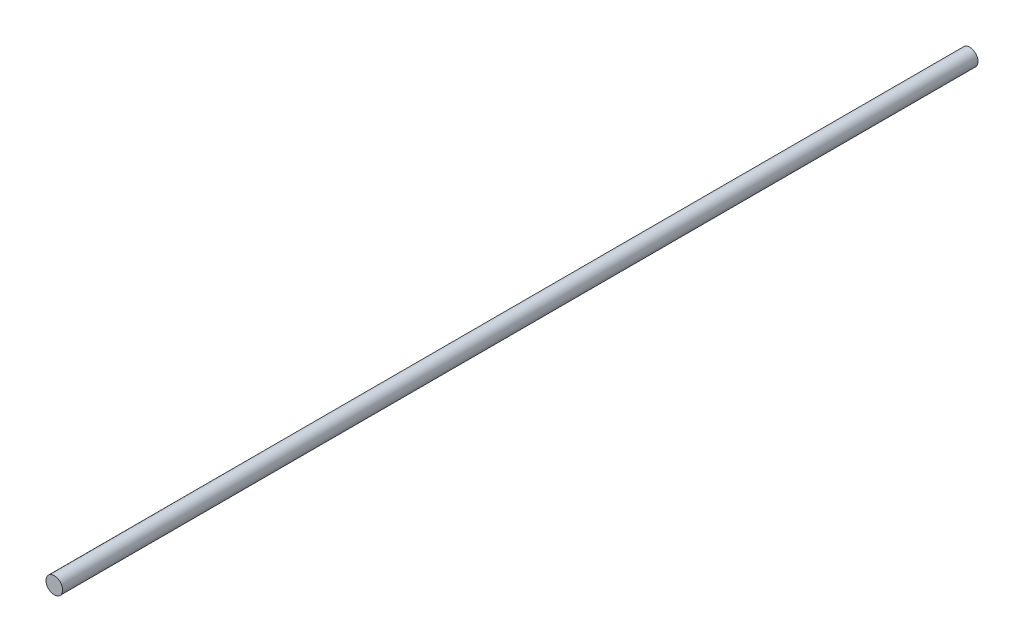
ISO-10303-21;
HEADER;
FILE_DESCRIPTION(('STEP AP214'),'2;1');
FILE_NAME('part.step','',(''),(''),'','','');
FILE_SCHEMA(('AUTOMOTIVE_DESIGN { 1 0 10303 214 1 1 1 1 }'));
ENDSEC;
DATA;
#1=APPLICATION_CONTEXT('core data for automotive mechanical design processes');
#2=APPLICATION_PROTOCOL_DEFINITION('international standard','automotive_design',2000,#1);
#3=PRODUCT_CONTEXT('',#1,'mechanical');
#4=PRODUCT('Part','Part','',(#3));
#5=PRODUCT_RELATED_PRODUCT_CATEGORY('part','',(#4));
#6=PRODUCT_DEFINITION_FORMATION('','',#4);
#7=PRODUCT_DEFINITION_CONTEXT('part definition',#1,'design');
#8=PRODUCT_DEFINITION('design','',#6,#7);
#9=PRODUCT_DEFINITION_SHAPE('','',#8);
#10=(LENGTH_UNIT() NAMED_UNIT(*) SI_UNIT(.MILLI.,.METRE.));
#11=(NAMED_UNIT(*) PLANE_ANGLE_UNIT() SI_UNIT($,.RADIAN.));
#12=(NAMED_UNIT(*) SI_UNIT($,.STERADIAN.) SOLID_ANGLE_UNIT());
#13=UNCERTAINTY_MEASURE_WITH_UNIT(LENGTH_MEASURE(1.E-05),#10,'distance_accuracy_value','');
#14=(GEOMETRIC_REPRESENTATION_CONTEXT(3) GLOBAL_UNCERTAINTY_ASSIGNED_CONTEXT((#13)) GLOBAL_UNIT_ASSIGNED_CONTEXT((#10,
#11,#12)) REPRESENTATION_CONTEXT('',''));
#15=CARTESIAN_POINT('',(0.,0.,0.));
#16=DIRECTION('',(0.,0.,1.));
#17=DIRECTION('',(1.,0.,0.));
#18=AXIS2_PLACEMENT_3D('',#15,#16,#17);
#19=CARTESIAN_POINT('',(0.,0.,662.));
#20=DIRECTION('',(0.,0.,-1.));
#21=DIRECTION('',(-1.,0.,0.));
#22=AXIS2_PLACEMENT_3D('',#19,#20,#21);
#23=CYLINDRICAL_SURFACE('',#22,6.);
#24=CARTESIAN_POINT('',(0.,0.,662.));
#25=DIRECTION('',(0.,0.,1.));
#26=DIRECTION('',(1.,0.,0.));
#27=AXIS2_PLACEMENT_3D('',#24,#25,#26);
#28=CIRCLE('',#27,6.);
#29=CARTESIAN_POINT('',(6.,0.,662.));
#30=VERTEX_POINT('',#29);
#31=EDGE_CURVE('E10',#30,#30,#28,.T.);
#32=ORIENTED_EDGE('',*,*,#31,.F.);
#33=EDGE_LOOP('',(#32));
#34=FACE_BOUND('',#33,.T.);
#35=CARTESIAN_POINT('',(0.,0.,0.));
#36=DIRECTION('',(0.,0.,1.));
#37=DIRECTION('',(1.,0.,0.));
#38=AXIS2_PLACEMENT_3D('',#35,#36,#37);
#39=CIRCLE('',#38,6.);
#40=CARTESIAN_POINT('',(6.,0.,0.));
#41=VERTEX_POINT('',#40);
#42=EDGE_CURVE('E34',#41,#41,#39,.T.);
#43=ORIENTED_EDGE('',*,*,#42,.T.);
#44=EDGE_LOOP('',(#43));
#45=FACE_BOUND('',#44,.T.);
#46=ADVANCED_FACE('F31',(#34,#45),#23,.T.);
#47=CARTESIAN_POINT('',(0.,0.,662.));
#48=DIRECTION('',(0.,0.,1.));
#49=DIRECTION('',(1.,0.,0.));
#50=AXIS2_PLACEMENT_3D('',#47,#48,#49);
#51=PLANE('',#50);
#52=ORIENTED_EDGE('',*,*,#31,.T.);
#53=EDGE_LOOP('',(#52));
#54=FACE_BOUND('',#53,.T.);
#55=ADVANCED_FACE('F46',(#54),#51,.T.);
#56=CARTESIAN_POINT('',(0.,0.,0.));
#57=DIRECTION('',(0.,0.,1.));
#58=DIRECTION('',(1.,0.,0.));
#59=AXIS2_PLACEMENT_3D('',#56,#57,#58);
#60=PLANE('',#59);
#61=ORIENTED_EDGE('',*,*,#42,.F.);
#62=EDGE_LOOP('',(#61));
#63=FACE_BOUND('',#62,.T.);
#64=ADVANCED_FACE('F44',(#63),#60,.F.);
#65=CLOSED_SHELL('',(#46,#55,#64));
#66=MANIFOLD_SOLID_BREP('B2',#65);
#67=ADVANCED_BREP_SHAPE_REPRESENTATION('',(#18,#66),#14);
#68=SHAPE_DEFINITION_REPRESENTATION(#9,#67);
ENDSEC;
END-ISO-10303-21;
